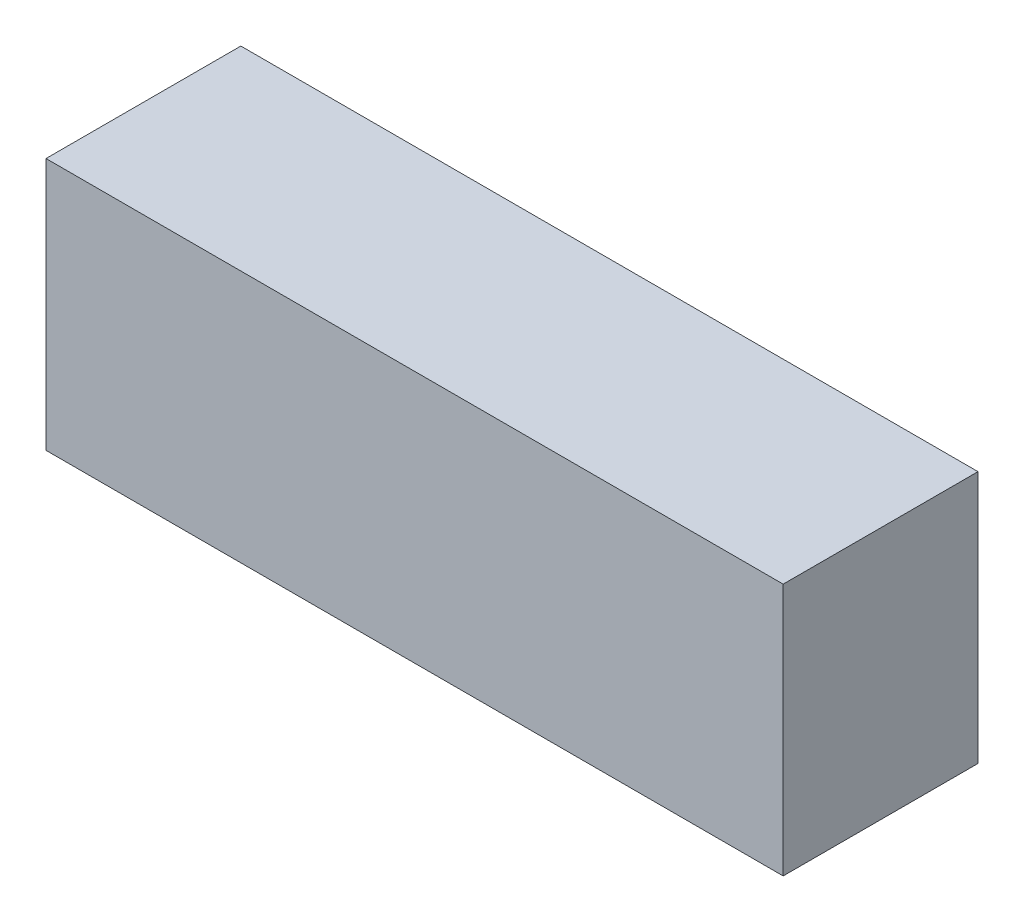
ISO-10303-21;
HEADER;
FILE_DESCRIPTION(('STEP AP214'),'2;1');
FILE_NAME('part.step','',(''),(''),'','','');
FILE_SCHEMA(('AUTOMOTIVE_DESIGN { 1 0 10303 214 1 1 1 1 }'));
ENDSEC;
DATA;
#1=APPLICATION_CONTEXT('core data for automotive mechanical design processes');
#2=APPLICATION_PROTOCOL_DEFINITION('international standard','automotive_design',2000,#1);
#3=PRODUCT_CONTEXT('',#1,'mechanical');
#4=PRODUCT('Part','Part','',(#3));
#5=PRODUCT_RELATED_PRODUCT_CATEGORY('part','',(#4));
#6=PRODUCT_DEFINITION_FORMATION('','',#4);
#7=PRODUCT_DEFINITION_CONTEXT('part definition',#1,'design');
#8=PRODUCT_DEFINITION('design','',#6,#7);
#9=PRODUCT_DEFINITION_SHAPE('','',#8);
#10=(LENGTH_UNIT() NAMED_UNIT(*) SI_UNIT(.MILLI.,.METRE.));
#11=(NAMED_UNIT(*) PLANE_ANGLE_UNIT() SI_UNIT($,.RADIAN.));
#12=(NAMED_UNIT(*) SI_UNIT($,.STERADIAN.) SOLID_ANGLE_UNIT());
#13=UNCERTAINTY_MEASURE_WITH_UNIT(LENGTH_MEASURE(1.E-05),#10,'distance_accuracy_value','');
#14=(GEOMETRIC_REPRESENTATION_CONTEXT(3) GLOBAL_UNCERTAINTY_ASSIGNED_CONTEXT((#13)) GLOBAL_UNIT_ASSIGNED_CONTEXT((#10,
#11,#12)) REPRESENTATION_CONTEXT('',''));
#15=CARTESIAN_POINT('',(0.,0.,0.));
#16=DIRECTION('',(0.,0.,1.));
#17=DIRECTION('',(1.,0.,0.));
#18=AXIS2_PLACEMENT_3D('',#15,#16,#17);
#19=CARTESIAN_POINT('',(32.0867730968519,0.,18.5));
#20=DIRECTION('',(0.,1.,0.));
#21=DIRECTION('',(0.,0.,1.));
#22=AXIS2_PLACEMENT_3D('',#19,#20,#21);
#23=PLANE('',#22);
#24=DIRECTION('',(1.,0.,0.));
#25=VECTOR('',#24,1.);
#26=CARTESIAN_POINT('',(32.0867730968519,0.,0.));
#27=LINE('',#26,#25);
#28=CARTESIAN_POINT('',(-37.9132269031481,0.,0.));
#29=VERTEX_POINT('',#28);
#30=CARTESIAN_POINT('',(32.0867730968519,0.,0.));
#31=VERTEX_POINT('',#30);
#32=EDGE_CURVE('E98',#29,#31,#27,.T.);
#33=ORIENTED_EDGE('',*,*,#32,.T.);
#34=DIRECTION('',(0.,0.,-1.));
#35=VECTOR('',#34,1.);
#36=CARTESIAN_POINT('',(32.0867730968519,0.,18.5));
#37=LINE('',#36,#35);
#38=CARTESIAN_POINT('',(32.0867730968519,0.,18.5));
#39=VERTEX_POINT('',#38);
#40=EDGE_CURVE('E11',#39,#31,#37,.T.);
#41=ORIENTED_EDGE('',*,*,#40,.F.);
#42=DIRECTION('',(1.,0.,0.));
#43=VECTOR('',#42,1.);
#44=CARTESIAN_POINT('',(32.0867730968519,0.,18.5));
#45=LINE('',#44,#43);
#46=CARTESIAN_POINT('',(-37.9132269031481,0.,18.5));
#47=VERTEX_POINT('',#46);
#48=EDGE_CURVE('E86',#47,#39,#45,.T.);
#49=ORIENTED_EDGE('',*,*,#48,.F.);
#50=DIRECTION('',(0.,0.,-1.));
#51=VECTOR('',#50,1.);
#52=CARTESIAN_POINT('',(-37.9132269031481,0.,18.5));
#53=LINE('',#52,#51);
#54=EDGE_CURVE('E94',#47,#29,#53,.T.);
#55=ORIENTED_EDGE('',*,*,#54,.T.);
#56=EDGE_LOOP('',(#33,#41,#49,#55));
#57=FACE_BOUND('',#56,.T.);
#58=ADVANCED_FACE('F35',(#57),#23,.F.);
#59=CARTESIAN_POINT('',(32.0867730968519,24.,18.5));
#60=DIRECTION('',(-1.,0.,0.));
#61=DIRECTION('',(0.,0.,1.));
#62=AXIS2_PLACEMENT_3D('',#59,#60,#61);
#63=PLANE('',#62);
#64=DIRECTION('',(0.,1.,0.));
#65=VECTOR('',#64,1.);
#66=CARTESIAN_POINT('',(32.0867730968519,24.,0.));
#67=LINE('',#66,#65);
#68=CARTESIAN_POINT('',(32.0867730968519,24.,0.));
#69=VERTEX_POINT('',#68);
#70=EDGE_CURVE('E90',#31,#69,#67,.T.);
#71=ORIENTED_EDGE('',*,*,#70,.T.);
#72=DIRECTION('',(0.,0.,-1.));
#73=VECTOR('',#72,1.);
#74=CARTESIAN_POINT('',(32.0867730968519,24.,18.5));
#75=LINE('',#74,#73);
#76=CARTESIAN_POINT('',(32.0867730968519,24.,18.5));
#77=VERTEX_POINT('',#76);
#78=EDGE_CURVE('E43',#77,#69,#75,.T.);
#79=ORIENTED_EDGE('',*,*,#78,.F.);
#80=DIRECTION('',(0.,1.,0.));
#81=VECTOR('',#80,1.);
#82=CARTESIAN_POINT('',(32.0867730968519,24.,18.5));
#83=LINE('',#82,#81);
#84=EDGE_CURVE('E81',#39,#77,#83,.T.);
#85=ORIENTED_EDGE('',*,*,#84,.F.);
#86=ORIENTED_EDGE('',*,*,#40,.T.);
#87=EDGE_LOOP('',(#71,#79,#85,#86));
#88=FACE_BOUND('',#87,.T.);
#89=ADVANCED_FACE('F89',(#88),#63,.F.);
#90=CARTESIAN_POINT('',(-37.9132269031481,24.,18.5));
#91=DIRECTION('',(0.,-1.,0.));
#92=DIRECTION('',(0.,0.,-1.));
#93=AXIS2_PLACEMENT_3D('',#90,#91,#92);
#94=PLANE('',#93);
#95=DIRECTION('',(-1.,0.,0.));
#96=VECTOR('',#95,1.);
#97=CARTESIAN_POINT('',(-37.9132269031481,24.,0.));
#98=LINE('',#97,#96);
#99=CARTESIAN_POINT('',(-37.9132269031481,24.,0.));
#100=VERTEX_POINT('',#99);
#101=EDGE_CURVE('E68',#69,#100,#98,.T.);
#102=ORIENTED_EDGE('',*,*,#101,.T.);
#103=DIRECTION('',(0.,0.,-1.));
#104=VECTOR('',#103,1.);
#105=CARTESIAN_POINT('',(-37.9132269031481,24.,18.5));
#106=LINE('',#105,#104);
#107=CARTESIAN_POINT('',(-37.9132269031481,24.,18.5));
#108=VERTEX_POINT('',#107);
#109=EDGE_CURVE('E91',#108,#100,#106,.T.);
#110=ORIENTED_EDGE('',*,*,#109,.F.);
#111=DIRECTION('',(-1.,0.,0.));
#112=VECTOR('',#111,1.);
#113=CARTESIAN_POINT('',(-37.9132269031481,24.,18.5));
#114=LINE('',#113,#112);
#115=EDGE_CURVE('E84',#77,#108,#114,.T.);
#116=ORIENTED_EDGE('',*,*,#115,.F.);
#117=ORIENTED_EDGE('',*,*,#78,.T.);
#118=EDGE_LOOP('',(#102,#110,#116,#117));
#119=FACE_BOUND('',#118,.T.);
#120=ADVANCED_FACE('F92',(#119),#94,.F.);
#121=CARTESIAN_POINT('',(-37.9132269031481,0.,18.5));
#122=DIRECTION('',(1.,0.,0.));
#123=DIRECTION('',(0.,0.,-1.));
#124=AXIS2_PLACEMENT_3D('',#121,#122,#123);
#125=PLANE('',#124);
#126=DIRECTION('',(0.,-1.,0.));
#127=VECTOR('',#126,1.);
#128=CARTESIAN_POINT('',(-37.9132269031481,0.,0.));
#129=LINE('',#128,#127);
#130=EDGE_CURVE('E74',#100,#29,#129,.T.);
#131=ORIENTED_EDGE('',*,*,#130,.T.);
#132=ORIENTED_EDGE('',*,*,#54,.F.);
#133=DIRECTION('',(0.,-1.,0.));
#134=VECTOR('',#133,1.);
#135=CARTESIAN_POINT('',(-37.9132269031481,0.,18.5));
#136=LINE('',#135,#134);
#137=EDGE_CURVE('E51',#108,#47,#136,.T.);
#138=ORIENTED_EDGE('',*,*,#137,.F.);
#139=ORIENTED_EDGE('',*,*,#109,.T.);
#140=EDGE_LOOP('',(#131,#132,#138,#139));
#141=FACE_BOUND('',#140,.T.);
#142=ADVANCED_FACE('F105',(#141),#125,.F.);
#143=CARTESIAN_POINT('',(0.,0.,18.5));
#144=DIRECTION('',(0.,0.,-1.));
#145=DIRECTION('',(-1.,0.,0.));
#146=AXIS2_PLACEMENT_3D('',#143,#144,#145);
#147=PLANE('',#146);
#148=ORIENTED_EDGE('',*,*,#48,.T.);
#149=ORIENTED_EDGE('',*,*,#84,.T.);
#150=ORIENTED_EDGE('',*,*,#115,.T.);
#151=ORIENTED_EDGE('',*,*,#137,.T.);
#152=EDGE_LOOP('',(#148,#149,#150,#151));
#153=FACE_BOUND('',#152,.T.);
#154=ADVANCED_FACE('F82',(#153),#147,.F.);
#155=CARTESIAN_POINT('',(0.,0.,0.));
#156=DIRECTION('',(0.,0.,-1.));
#157=DIRECTION('',(-1.,0.,0.));
#158=AXIS2_PLACEMENT_3D('',#155,#156,#157);
#159=PLANE('',#158);
#160=ORIENTED_EDGE('',*,*,#32,.F.);
#161=ORIENTED_EDGE('',*,*,#130,.F.);
#162=ORIENTED_EDGE('',*,*,#101,.F.);
#163=ORIENTED_EDGE('',*,*,#70,.F.);
#164=EDGE_LOOP('',(#160,#161,#162,#163));
#165=FACE_BOUND('',#164,.T.);
#166=ADVANCED_FACE('F108',(#165),#159,.T.);
#167=CLOSED_SHELL('',(#58,#89,#120,#142,#154,#166));
#168=MANIFOLD_SOLID_BREP('B2',#167);
#169=ADVANCED_BREP_SHAPE_REPRESENTATION('',(#18,#168),#14);
#170=SHAPE_DEFINITION_REPRESENTATION(#9,#169);
ENDSEC;
END-ISO-10303-21;
